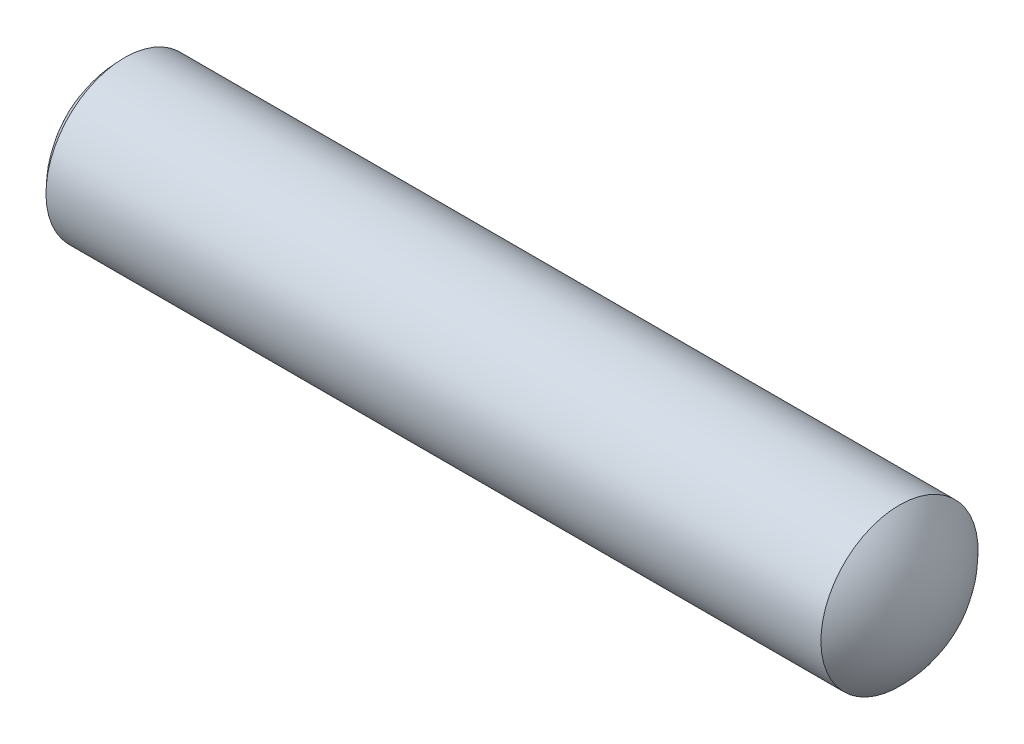
ISO-10303-21;
HEADER;
FILE_DESCRIPTION(('STEP AP214'),'2;1');
FILE_NAME('part.step','',(''),(''),'','','');
FILE_SCHEMA(('AUTOMOTIVE_DESIGN { 1 0 10303 214 1 1 1 1 }'));
ENDSEC;
DATA;
#1=APPLICATION_CONTEXT('core data for automotive mechanical design processes');
#2=APPLICATION_PROTOCOL_DEFINITION('international standard','automotive_design',2000,#1);
#3=PRODUCT_CONTEXT('',#1,'mechanical');
#4=PRODUCT('Part','Part','',(#3));
#5=PRODUCT_RELATED_PRODUCT_CATEGORY('part','',(#4));
#6=PRODUCT_DEFINITION_FORMATION('','',#4);
#7=PRODUCT_DEFINITION_CONTEXT('part definition',#1,'design');
#8=PRODUCT_DEFINITION('design','',#6,#7);
#9=PRODUCT_DEFINITION_SHAPE('','',#8);
#10=(LENGTH_UNIT() NAMED_UNIT(*) SI_UNIT(.MILLI.,.METRE.));
#11=(NAMED_UNIT(*) PLANE_ANGLE_UNIT() SI_UNIT($,.RADIAN.));
#12=(NAMED_UNIT(*) SI_UNIT($,.STERADIAN.) SOLID_ANGLE_UNIT());
#13=UNCERTAINTY_MEASURE_WITH_UNIT(LENGTH_MEASURE(1.E-05),#10,'distance_accuracy_value','');
#14=(GEOMETRIC_REPRESENTATION_CONTEXT(3) GLOBAL_UNCERTAINTY_ASSIGNED_CONTEXT((#13)) GLOBAL_UNIT_ASSIGNED_CONTEXT((#10,
#11,#12)) REPRESENTATION_CONTEXT('',''));
#15=CARTESIAN_POINT('',(0.,0.,0.));
#16=DIRECTION('',(0.,0.,1.));
#17=DIRECTION('',(1.,0.,0.));
#18=AXIS2_PLACEMENT_3D('',#15,#16,#17);
#19=CARTESIAN_POINT('',(15.1875,-13.9567193922089,-16.1069128034251));
#20=DIRECTION('',(0.,0.755749574354258,-0.654860733945285));
#21=DIRECTION('',(1.,0.,0.));
#22=AXIS2_PLACEMENT_3D('',#19,#20,#21);
#23=SPHERICAL_SURFACE('',#22,1.8375);
#24=CARTESIAN_POINT('',(15.1875,-13.9567193922089,-16.1069128034251));
#25=DIRECTION('',(-1.,0.,0.));
#26=DIRECTION('',(0.,0.654860733945285,0.755749574354258));
#27=AXIS2_PLACEMENT_3D('',#24,#25,#26);
#28=SPHERICAL_SURFACE('',#27,1.8375);
#29=CARTESIAN_POINT('',(16.4734821149612,-13.9567193922089,-16.1069128034251));
#30=DIRECTION('',(-1.,0.,0.));
#31=DIRECTION('',(0.,0.654860733945285,0.755749574354258));
#32=AXIS2_PLACEMENT_3D('',#29,#30,#31);
#33=CIRCLE('',#32,1.3125);
#34=CARTESIAN_POINT('',(16.4734821149612,-13.0972146789057,-15.1149914870851));
#35=VERTEX_POINT('',#34);
#36=EDGE_CURVE('E11',#35,#35,#33,.T.);
#37=ORIENTED_EDGE('',*,*,#36,.F.);
#38=EDGE_LOOP('',(#37));
#39=FACE_BOUND('',#38,.T.);
#40=ADVANCED_FACE('F17',(#39),#28,.T.);
#41=CARTESIAN_POINT('',(10.,-13.9567193922089,-16.1069128034251));
#42=DIRECTION('',(-1.,0.,0.));
#43=DIRECTION('',(0.,0.654860733945285,0.755749574354258));
#44=AXIS2_PLACEMENT_3D('',#41,#42,#43);
#45=CYLINDRICAL_SURFACE('',#44,1.3125);
#46=CARTESIAN_POINT('',(3.52651788503884,-13.9567193922089,-16.1069128034251));
#47=DIRECTION('',(-1.,0.,0.));
#48=DIRECTION('',(0.,0.654860733945285,0.755749574354258));
#49=AXIS2_PLACEMENT_3D('',#46,#47,#48);
#50=CIRCLE('',#49,1.3125);
#51=CARTESIAN_POINT('',(3.52651788503884,-13.0972146789057,-15.1149914870851));
#52=VERTEX_POINT('',#51);
#53=EDGE_CURVE('E26',#52,#52,#50,.T.);
#54=ORIENTED_EDGE('',*,*,#53,.F.);
#55=EDGE_LOOP('',(#54));
#56=FACE_BOUND('',#55,.T.);
#57=ORIENTED_EDGE('',*,*,#36,.T.);
#58=EDGE_LOOP('',(#57));
#59=FACE_BOUND('',#58,.T.);
#60=ADVANCED_FACE('F51',(#56,#59),#45,.T.);
#61=CARTESIAN_POINT('',(4.8125,-13.9567193922089,-16.1069128034251));
#62=DIRECTION('',(0.,0.755749574354258,-0.654860733945285));
#63=DIRECTION('',(-1.,0.,0.));
#64=AXIS2_PLACEMENT_3D('',#61,#62,#63);
#65=SPHERICAL_SURFACE('',#64,1.8375);
#66=CARTESIAN_POINT('',(4.8125,-13.9567193922089,-16.1069128034251));
#67=DIRECTION('',(-1.,0.,0.));
#68=DIRECTION('',(0.,0.654860733945285,0.755749574354258));
#69=AXIS2_PLACEMENT_3D('',#66,#67,#68);
#70=SPHERICAL_SURFACE('',#69,1.8375);
#71=ORIENTED_EDGE('',*,*,#53,.T.);
#72=EDGE_LOOP('',(#71));
#73=FACE_BOUND('',#72,.T.);
#74=ADVANCED_FACE('F39',(#73),#70,.T.);
#75=CLOSED_SHELL('',(#40,#60,#74));
#76=MANIFOLD_SOLID_BREP('B1',#75);
#77=ADVANCED_BREP_SHAPE_REPRESENTATION('',(#18,#76),#14);
#78=SHAPE_DEFINITION_REPRESENTATION(#9,#77);
ENDSEC;
END-ISO-10303-21;
